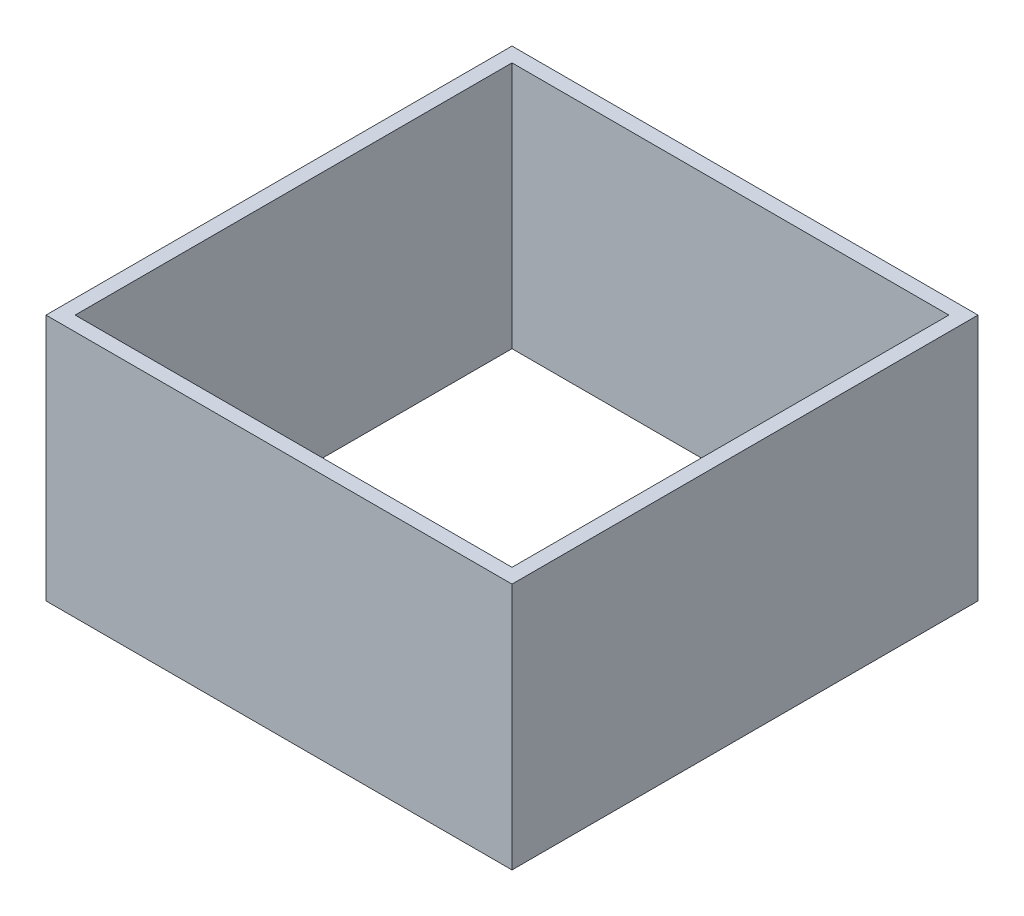
ISO-10303-21;
HEADER;
FILE_DESCRIPTION(('STEP AP214'),'2;1');
FILE_NAME('part.step','',(''),(''),'','','');
FILE_SCHEMA(('AUTOMOTIVE_DESIGN { 1 0 10303 214 1 1 1 1 }'));
ENDSEC;
DATA;
#1=APPLICATION_CONTEXT('core data for automotive mechanical design processes');
#2=APPLICATION_PROTOCOL_DEFINITION('international standard','automotive_design',2000,#1);
#3=PRODUCT_CONTEXT('',#1,'mechanical');
#4=PRODUCT('Part','Part','',(#3));
#5=PRODUCT_RELATED_PRODUCT_CATEGORY('part','',(#4));
#6=PRODUCT_DEFINITION_FORMATION('','',#4);
#7=PRODUCT_DEFINITION_CONTEXT('part definition',#1,'design');
#8=PRODUCT_DEFINITION('design','',#6,#7);
#9=PRODUCT_DEFINITION_SHAPE('','',#8);
#10=(LENGTH_UNIT() NAMED_UNIT(*) SI_UNIT(.MILLI.,.METRE.));
#11=(NAMED_UNIT(*) PLANE_ANGLE_UNIT() SI_UNIT($,.RADIAN.));
#12=(NAMED_UNIT(*) SI_UNIT($,.STERADIAN.) SOLID_ANGLE_UNIT());
#13=UNCERTAINTY_MEASURE_WITH_UNIT(LENGTH_MEASURE(1.E-05),#10,'distance_accuracy_value','');
#14=(GEOMETRIC_REPRESENTATION_CONTEXT(3) GLOBAL_UNCERTAINTY_ASSIGNED_CONTEXT((#13)) GLOBAL_UNIT_ASSIGNED_CONTEXT((#10,
#11,#12)) REPRESENTATION_CONTEXT('',''));
#15=CARTESIAN_POINT('',(0.,0.,0.));
#16=DIRECTION('',(0.,0.,1.));
#17=DIRECTION('',(1.,0.,0.));
#18=AXIS2_PLACEMENT_3D('',#15,#16,#17);
#19=CARTESIAN_POINT('',(0.,53.975,0.));
#20=DIRECTION('',(0.,1.,0.));
#21=DIRECTION('',(0.,0.,1.));
#22=AXIS2_PLACEMENT_3D('',#19,#20,#21);
#23=PLANE('',#22);
#24=DIRECTION('',(0.,0.,-1.));
#25=VECTOR('',#24,1.);
#26=CARTESIAN_POINT('',(50.8,53.975,-50.8));
#27=LINE('',#26,#25);
#28=CARTESIAN_POINT('',(50.8,53.975,50.8));
#29=VERTEX_POINT('',#28);
#30=CARTESIAN_POINT('',(50.8,53.975,-50.8));
#31=VERTEX_POINT('',#30);
#32=EDGE_CURVE('E133',#29,#31,#27,.T.);
#33=ORIENTED_EDGE('',*,*,#32,.T.);
#34=DIRECTION('',(-1.,0.,0.));
#35=VECTOR('',#34,1.);
#36=CARTESIAN_POINT('',(-50.8,53.975,-50.8));
#37=LINE('',#36,#35);
#38=CARTESIAN_POINT('',(-50.8,53.975,-50.8));
#39=VERTEX_POINT('',#38);
#40=EDGE_CURVE('E136',#31,#39,#37,.T.);
#41=ORIENTED_EDGE('',*,*,#40,.T.);
#42=DIRECTION('',(0.,0.,1.));
#43=VECTOR('',#42,1.);
#44=CARTESIAN_POINT('',(-50.8,53.975,-50.8));
#45=LINE('',#44,#43);
#46=CARTESIAN_POINT('',(-50.8,53.975,50.8));
#47=VERTEX_POINT('',#46);
#48=EDGE_CURVE('E139',#39,#47,#45,.T.);
#49=ORIENTED_EDGE('',*,*,#48,.T.);
#50=DIRECTION('',(1.,0.,0.));
#51=VECTOR('',#50,1.);
#52=CARTESIAN_POINT('',(-50.8,53.975,50.8));
#53=LINE('',#52,#51);
#54=EDGE_CURVE('E141',#47,#29,#53,.T.);
#55=ORIENTED_EDGE('',*,*,#54,.T.);
#56=EDGE_LOOP('',(#33,#41,#49,#55));
#57=FACE_BOUND('',#56,.T.);
#58=DIRECTION('',(-1.,0.,0.));
#59=VECTOR('',#58,1.);
#60=CARTESIAN_POINT('',(-47.625,53.975,-47.625));
#61=LINE('',#60,#59);
#62=CARTESIAN_POINT('',(47.625,53.975,-47.625));
#63=VERTEX_POINT('',#62);
#64=CARTESIAN_POINT('',(-47.625,53.975,-47.625));
#65=VERTEX_POINT('',#64);
#66=EDGE_CURVE('E105',#63,#65,#61,.T.);
#67=ORIENTED_EDGE('',*,*,#66,.F.);
#68=DIRECTION('',(0.,0.,-1.));
#69=VECTOR('',#68,1.);
#70=CARTESIAN_POINT('',(47.625,53.975,-47.625));
#71=LINE('',#70,#69);
#72=CARTESIAN_POINT('',(47.625,53.975,47.625));
#73=VERTEX_POINT('',#72);
#74=EDGE_CURVE('E97',#73,#63,#71,.T.);
#75=ORIENTED_EDGE('',*,*,#74,.F.);
#76=DIRECTION('',(1.,0.,0.));
#77=VECTOR('',#76,1.);
#78=CARTESIAN_POINT('',(-47.625,53.975,47.625));
#79=LINE('',#78,#77);
#80=CARTESIAN_POINT('',(-47.625,53.975,47.625));
#81=VERTEX_POINT('',#80);
#82=EDGE_CURVE('E119',#81,#73,#79,.T.);
#83=ORIENTED_EDGE('',*,*,#82,.F.);
#84=DIRECTION('',(0.,0.,1.));
#85=VECTOR('',#84,1.);
#86=CARTESIAN_POINT('',(-47.625,53.975,-47.625));
#87=LINE('',#86,#85);
#88=EDGE_CURVE('E117',#65,#81,#87,.T.);
#89=ORIENTED_EDGE('',*,*,#88,.F.);
#90=EDGE_LOOP('',(#67,#75,#83,#89));
#91=FACE_BOUND('',#90,.T.);
#92=ADVANCED_FACE('F32',(#57,#91),#23,.T.);
#93=CARTESIAN_POINT('',(0.,0.,0.));
#94=DIRECTION('',(0.,1.,0.));
#95=DIRECTION('',(0.,0.,1.));
#96=AXIS2_PLACEMENT_3D('',#93,#94,#95);
#97=PLANE('',#96);
#98=DIRECTION('',(0.,0.,-1.));
#99=VECTOR('',#98,1.);
#100=CARTESIAN_POINT('',(50.8,0.,-50.8));
#101=LINE('',#100,#99);
#102=CARTESIAN_POINT('',(50.8,0.,50.8));
#103=VERTEX_POINT('',#102);
#104=CARTESIAN_POINT('',(50.8,0.,-50.8));
#105=VERTEX_POINT('',#104);
#106=EDGE_CURVE('E113',#103,#105,#101,.T.);
#107=ORIENTED_EDGE('',*,*,#106,.F.);
#108=DIRECTION('',(1.,0.,0.));
#109=VECTOR('',#108,1.);
#110=CARTESIAN_POINT('',(-50.8,0.,50.8));
#111=LINE('',#110,#109);
#112=CARTESIAN_POINT('',(-50.8,0.,50.8));
#113=VERTEX_POINT('',#112);
#114=EDGE_CURVE('E137',#113,#103,#111,.T.);
#115=ORIENTED_EDGE('',*,*,#114,.F.);
#116=DIRECTION('',(0.,0.,1.));
#117=VECTOR('',#116,1.);
#118=CARTESIAN_POINT('',(-50.8,0.,-50.8));
#119=LINE('',#118,#117);
#120=CARTESIAN_POINT('',(-50.8,0.,-50.8));
#121=VERTEX_POINT('',#120);
#122=EDGE_CURVE('E148',#121,#113,#119,.T.);
#123=ORIENTED_EDGE('',*,*,#122,.F.);
#124=DIRECTION('',(-1.,0.,0.));
#125=VECTOR('',#124,1.);
#126=CARTESIAN_POINT('',(-50.8,0.,-50.8));
#127=LINE('',#126,#125);
#128=EDGE_CURVE('E146',#105,#121,#127,.T.);
#129=ORIENTED_EDGE('',*,*,#128,.F.);
#130=EDGE_LOOP('',(#107,#115,#123,#129));
#131=FACE_BOUND('',#130,.T.);
#132=DIRECTION('',(0.,0.,-1.));
#133=VECTOR('',#132,1.);
#134=CARTESIAN_POINT('',(47.625,0.,-47.625));
#135=LINE('',#134,#133);
#136=CARTESIAN_POINT('',(47.625,0.,47.625));
#137=VERTEX_POINT('',#136);
#138=CARTESIAN_POINT('',(47.625,0.,-47.625));
#139=VERTEX_POINT('',#138);
#140=EDGE_CURVE('E55',#137,#139,#135,.T.);
#141=ORIENTED_EDGE('',*,*,#140,.T.);
#142=DIRECTION('',(-1.,0.,0.));
#143=VECTOR('',#142,1.);
#144=CARTESIAN_POINT('',(-47.625,0.,-47.625));
#145=LINE('',#144,#143);
#146=CARTESIAN_POINT('',(-47.625,0.,-47.625));
#147=VERTEX_POINT('',#146);
#148=EDGE_CURVE('E112',#139,#147,#145,.T.);
#149=ORIENTED_EDGE('',*,*,#148,.T.);
#150=DIRECTION('',(0.,0.,1.));
#151=VECTOR('',#150,1.);
#152=CARTESIAN_POINT('',(-47.625,0.,-47.625));
#153=LINE('',#152,#151);
#154=CARTESIAN_POINT('',(-47.625,0.,47.625));
#155=VERTEX_POINT('',#154);
#156=EDGE_CURVE('E125',#147,#155,#153,.T.);
#157=ORIENTED_EDGE('',*,*,#156,.T.);
#158=DIRECTION('',(1.,0.,0.));
#159=VECTOR('',#158,1.);
#160=CARTESIAN_POINT('',(-47.625,0.,47.625));
#161=LINE('',#160,#159);
#162=EDGE_CURVE('E106',#155,#137,#161,.T.);
#163=ORIENTED_EDGE('',*,*,#162,.T.);
#164=EDGE_LOOP('',(#141,#149,#157,#163));
#165=FACE_BOUND('',#164,.T.);
#166=ADVANCED_FACE('F166',(#131,#165),#97,.F.);
#167=CARTESIAN_POINT('',(50.8,53.975,-50.8));
#168=DIRECTION('',(-1.,0.,0.));
#169=DIRECTION('',(0.,0.,1.));
#170=AXIS2_PLACEMENT_3D('',#167,#168,#169);
#171=PLANE('',#170);
#172=ORIENTED_EDGE('',*,*,#106,.T.);
#173=DIRECTION('',(0.,-1.,0.));
#174=VECTOR('',#173,1.);
#175=CARTESIAN_POINT('',(50.8,53.975,-50.8));
#176=LINE('',#175,#174);
#177=EDGE_CURVE('E11',#31,#105,#176,.T.);
#178=ORIENTED_EDGE('',*,*,#177,.F.);
#179=ORIENTED_EDGE('',*,*,#32,.F.);
#180=DIRECTION('',(0.,-1.,0.));
#181=VECTOR('',#180,1.);
#182=CARTESIAN_POINT('',(50.8,53.975,50.8));
#183=LINE('',#182,#181);
#184=EDGE_CURVE('E143',#29,#103,#183,.T.);
#185=ORIENTED_EDGE('',*,*,#184,.T.);
#186=EDGE_LOOP('',(#172,#178,#179,#185));
#187=FACE_BOUND('',#186,.T.);
#188=ADVANCED_FACE('F34',(#187),#171,.F.);
#189=CARTESIAN_POINT('',(-50.8,53.975,-50.8));
#190=DIRECTION('',(0.,0.,1.));
#191=DIRECTION('',(1.,0.,0.));
#192=AXIS2_PLACEMENT_3D('',#189,#190,#191);
#193=PLANE('',#192);
#194=ORIENTED_EDGE('',*,*,#128,.T.);
#195=DIRECTION('',(0.,-1.,0.));
#196=VECTOR('',#195,1.);
#197=CARTESIAN_POINT('',(-50.8,53.975,-50.8));
#198=LINE('',#197,#196);
#199=EDGE_CURVE('E40',#39,#121,#198,.T.);
#200=ORIENTED_EDGE('',*,*,#199,.F.);
#201=ORIENTED_EDGE('',*,*,#40,.F.);
#202=ORIENTED_EDGE('',*,*,#177,.T.);
#203=EDGE_LOOP('',(#194,#200,#201,#202));
#204=FACE_BOUND('',#203,.T.);
#205=ADVANCED_FACE('F176',(#204),#193,.F.);
#206=CARTESIAN_POINT('',(-50.8,53.975,-50.8));
#207=DIRECTION('',(1.,0.,0.));
#208=DIRECTION('',(0.,0.,-1.));
#209=AXIS2_PLACEMENT_3D('',#206,#207,#208);
#210=PLANE('',#209);
#211=ORIENTED_EDGE('',*,*,#122,.T.);
#212=DIRECTION('',(0.,-1.,0.));
#213=VECTOR('',#212,1.);
#214=CARTESIAN_POINT('',(-50.8,53.975,50.8));
#215=LINE('',#214,#213);
#216=EDGE_CURVE('E153',#47,#113,#215,.T.);
#217=ORIENTED_EDGE('',*,*,#216,.F.);
#218=ORIENTED_EDGE('',*,*,#48,.F.);
#219=ORIENTED_EDGE('',*,*,#199,.T.);
#220=EDGE_LOOP('',(#211,#217,#218,#219));
#221=FACE_BOUND('',#220,.T.);
#222=ADVANCED_FACE('F160',(#221),#210,.F.);
#223=CARTESIAN_POINT('',(-50.8,53.975,50.8));
#224=DIRECTION('',(0.,0.,-1.));
#225=DIRECTION('',(-1.,0.,0.));
#226=AXIS2_PLACEMENT_3D('',#223,#224,#225);
#227=PLANE('',#226);
#228=ORIENTED_EDGE('',*,*,#114,.T.);
#229=ORIENTED_EDGE('',*,*,#184,.F.);
#230=ORIENTED_EDGE('',*,*,#54,.F.);
#231=ORIENTED_EDGE('',*,*,#216,.T.);
#232=EDGE_LOOP('',(#228,#229,#230,#231));
#233=FACE_BOUND('',#232,.T.);
#234=ADVANCED_FACE('F170',(#233),#227,.F.);
#235=CARTESIAN_POINT('',(47.625,53.975,-47.625));
#236=DIRECTION('',(-1.,0.,0.));
#237=DIRECTION('',(0.,0.,1.));
#238=AXIS2_PLACEMENT_3D('',#235,#236,#237);
#239=PLANE('',#238);
#240=ORIENTED_EDGE('',*,*,#140,.F.);
#241=DIRECTION('',(0.,-1.,0.));
#242=VECTOR('',#241,1.);
#243=CARTESIAN_POINT('',(47.625,53.975,47.625));
#244=LINE('',#243,#242);
#245=EDGE_CURVE('E101',#73,#137,#244,.T.);
#246=ORIENTED_EDGE('',*,*,#245,.F.);
#247=ORIENTED_EDGE('',*,*,#74,.T.);
#248=DIRECTION('',(0.,-1.,0.));
#249=VECTOR('',#248,1.);
#250=CARTESIAN_POINT('',(47.625,53.975,-47.625));
#251=LINE('',#250,#249);
#252=EDGE_CURVE('E100',#63,#139,#251,.T.);
#253=ORIENTED_EDGE('',*,*,#252,.T.);
#254=EDGE_LOOP('',(#240,#246,#247,#253));
#255=FACE_BOUND('',#254,.T.);
#256=ADVANCED_FACE('F99',(#255),#239,.T.);
#257=CARTESIAN_POINT('',(-47.625,53.975,-47.625));
#258=DIRECTION('',(0.,0.,1.));
#259=DIRECTION('',(1.,0.,0.));
#260=AXIS2_PLACEMENT_3D('',#257,#258,#259);
#261=PLANE('',#260);
#262=ORIENTED_EDGE('',*,*,#148,.F.);
#263=ORIENTED_EDGE('',*,*,#252,.F.);
#264=ORIENTED_EDGE('',*,*,#66,.T.);
#265=DIRECTION('',(0.,-1.,0.));
#266=VECTOR('',#265,1.);
#267=CARTESIAN_POINT('',(-47.625,53.975,-47.625));
#268=LINE('',#267,#266);
#269=EDGE_CURVE('E114',#65,#147,#268,.T.);
#270=ORIENTED_EDGE('',*,*,#269,.T.);
#271=EDGE_LOOP('',(#262,#263,#264,#270));
#272=FACE_BOUND('',#271,.T.);
#273=ADVANCED_FACE('F109',(#272),#261,.T.);
#274=CARTESIAN_POINT('',(-47.625,53.975,-47.625));
#275=DIRECTION('',(1.,0.,0.));
#276=DIRECTION('',(0.,0.,-1.));
#277=AXIS2_PLACEMENT_3D('',#274,#275,#276);
#278=PLANE('',#277);
#279=ORIENTED_EDGE('',*,*,#156,.F.);
#280=ORIENTED_EDGE('',*,*,#269,.F.);
#281=ORIENTED_EDGE('',*,*,#88,.T.);
#282=DIRECTION('',(0.,-1.,0.));
#283=VECTOR('',#282,1.);
#284=CARTESIAN_POINT('',(-47.625,53.975,47.625));
#285=LINE('',#284,#283);
#286=EDGE_CURVE('E47',#81,#155,#285,.T.);
#287=ORIENTED_EDGE('',*,*,#286,.T.);
#288=EDGE_LOOP('',(#279,#280,#281,#287));
#289=FACE_BOUND('',#288,.T.);
#290=ADVANCED_FACE('F199',(#289),#278,.T.);
#291=CARTESIAN_POINT('',(-47.625,53.975,47.625));
#292=DIRECTION('',(0.,0.,-1.));
#293=DIRECTION('',(-1.,0.,0.));
#294=AXIS2_PLACEMENT_3D('',#291,#292,#293);
#295=PLANE('',#294);
#296=ORIENTED_EDGE('',*,*,#162,.F.);
#297=ORIENTED_EDGE('',*,*,#286,.F.);
#298=ORIENTED_EDGE('',*,*,#82,.T.);
#299=ORIENTED_EDGE('',*,*,#245,.T.);
#300=EDGE_LOOP('',(#296,#297,#298,#299));
#301=FACE_BOUND('',#300,.T.);
#302=ADVANCED_FACE('F203',(#301),#295,.T.);
#303=CLOSED_SHELL('',(#92,#166,#188,#205,#222,#234,#256,#273,#290,#302));
#304=MANIFOLD_SOLID_BREP('B2',#303);
#305=ADVANCED_BREP_SHAPE_REPRESENTATION('',(#18,#304),#14);
#306=SHAPE_DEFINITION_REPRESENTATION(#9,#305);
ENDSEC;
END-ISO-10303-21;
